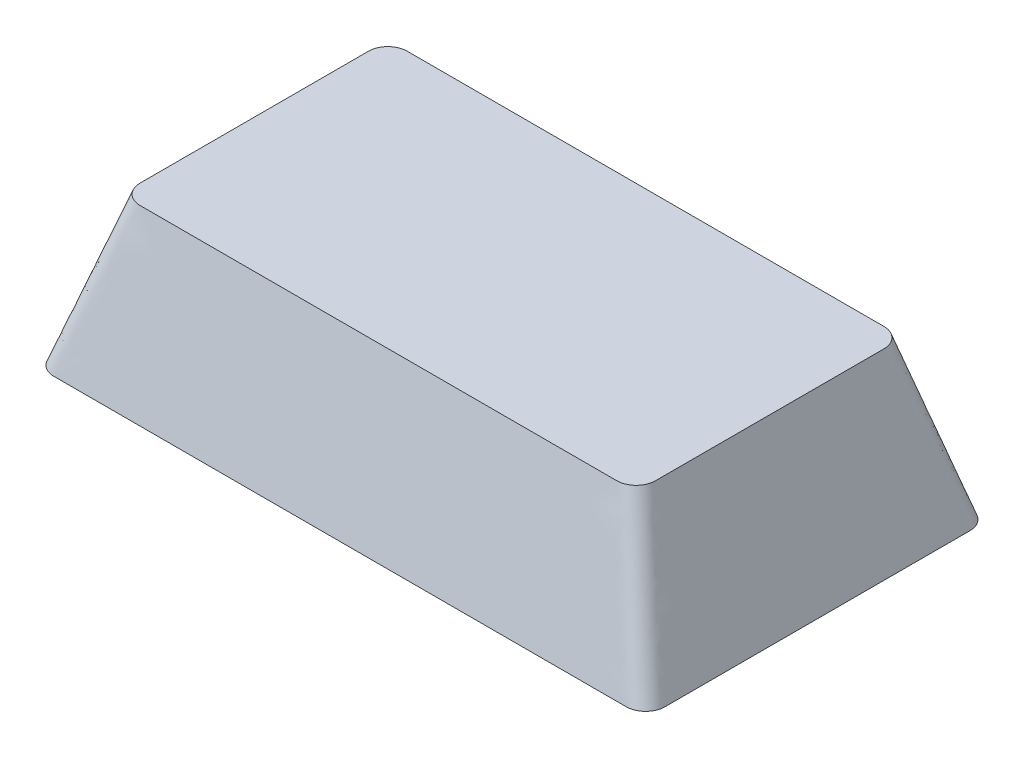
ISO-10303-21;
HEADER;
FILE_DESCRIPTION(('STEP AP214'),'2;1');
FILE_NAME('part.step','',(''),(''),'','','');
FILE_SCHEMA(('AUTOMOTIVE_DESIGN { 1 0 10303 214 1 1 1 1 }'));
ENDSEC;
DATA;
#1=APPLICATION_CONTEXT('core data for automotive mechanical design processes');
#2=APPLICATION_PROTOCOL_DEFINITION('international standard','automotive_design',2000,#1);
#3=PRODUCT_CONTEXT('',#1,'mechanical');
#4=PRODUCT('Part','Part','',(#3));
#5=PRODUCT_RELATED_PRODUCT_CATEGORY('part','',(#4));
#6=PRODUCT_DEFINITION_FORMATION('','',#4);
#7=PRODUCT_DEFINITION_CONTEXT('part definition',#1,'design');
#8=PRODUCT_DEFINITION('design','',#6,#7);
#9=PRODUCT_DEFINITION_SHAPE('','',#8);
#10=(LENGTH_UNIT() NAMED_UNIT(*) SI_UNIT(.MILLI.,.METRE.));
#11=(NAMED_UNIT(*) PLANE_ANGLE_UNIT() SI_UNIT($,.RADIAN.));
#12=(NAMED_UNIT(*) SI_UNIT($,.STERADIAN.) SOLID_ANGLE_UNIT());
#13=UNCERTAINTY_MEASURE_WITH_UNIT(LENGTH_MEASURE(1.E-05),#10,'distance_accuracy_value','');
#14=(GEOMETRIC_REPRESENTATION_CONTEXT(3) GLOBAL_UNCERTAINTY_ASSIGNED_CONTEXT((#13)) GLOBAL_UNIT_ASSIGNED_CONTEXT((#10,
#11,#12)) REPRESENTATION_CONTEXT('',''));
#15=CARTESIAN_POINT('',(0.,0.,0.));
#16=DIRECTION('',(0.,0.,1.));
#17=DIRECTION('',(1.,0.,0.));
#18=AXIS2_PLACEMENT_3D('',#15,#16,#17);
#19=CARTESIAN_POINT('',(-14.986,0.,-7.9883));
#20=DIRECTION('',(0.,-1.,0.));
#21=DIRECTION('',(0.,0.,-1.));
#22=AXIS2_PLACEMENT_3D('',#19,#20,#21);
#23=PLANE('',#22);
#24=CARTESIAN_POINT('',(-14.986,0.,-7.9883));
#25=DIRECTION('',(0.,1.,0.));
#26=DIRECTION('',(0.,0.,-1.));
#27=AXIS2_PLACEMENT_3D('',#24,#25,#26);
#28=CIRCLE('',#27,1.016);
#29=CARTESIAN_POINT('',(-14.9859999999087,0.,-9.0043));
#30=VERTEX_POINT('',#29);
#31=CARTESIAN_POINT('',(-16.002,0.,-7.9883));
#32=VERTEX_POINT('',#31);
#33=EDGE_CURVE('E323',#30,#32,#28,.T.);
#34=ORIENTED_EDGE('',*,*,#33,.F.);
#35=DIRECTION('',(-1.,0.,0.));
#36=VECTOR('',#35,1.);
#37=CARTESIAN_POINT('',(-14.986,0.,-9.0043));
#38=LINE('',#37,#36);
#39=CARTESIAN_POINT('',(14.986,0.,-9.0043));
#40=VERTEX_POINT('',#39);
#41=EDGE_CURVE('E578',#40,#30,#38,.T.);
#42=ORIENTED_EDGE('',*,*,#41,.F.);
#43=CARTESIAN_POINT('',(14.986,0.,-7.9883));
#44=DIRECTION('',(0.,1.,0.));
#45=DIRECTION('',(0.,0.,-1.));
#46=AXIS2_PLACEMENT_3D('',#43,#44,#45);
#47=CIRCLE('',#46,1.016);
#48=CARTESIAN_POINT('',(16.002,0.,-7.98829999999407));
#49=VERTEX_POINT('',#48);
#50=EDGE_CURVE('E562',#49,#40,#47,.T.);
#51=ORIENTED_EDGE('',*,*,#50,.F.);
#52=DIRECTION('',(0.,0.,-1.));
#53=VECTOR('',#52,1.);
#54=CARTESIAN_POINT('',(16.002,0.,7.9883));
#55=LINE('',#54,#53);
#56=CARTESIAN_POINT('',(16.002,0.,7.98829999998683));
#57=VERTEX_POINT('',#56);
#58=EDGE_CURVE('E551',#57,#49,#55,.T.);
#59=ORIENTED_EDGE('',*,*,#58,.F.);
#60=CARTESIAN_POINT('',(14.986,0.,7.9883));
#61=DIRECTION('',(0.,1.,0.));
#62=DIRECTION('',(0.,0.,1.));
#63=AXIS2_PLACEMENT_3D('',#60,#61,#62);
#64=CIRCLE('',#63,1.016);
#65=CARTESIAN_POINT('',(14.9859999999089,0.,9.0043));
#66=VERTEX_POINT('',#65);
#67=EDGE_CURVE('E549',#66,#57,#64,.T.);
#68=ORIENTED_EDGE('',*,*,#67,.F.);
#69=DIRECTION('',(1.,0.,0.));
#70=VECTOR('',#69,1.);
#71=CARTESIAN_POINT('',(-14.986,0.,9.0043));
#72=LINE('',#71,#70);
#73=CARTESIAN_POINT('',(-14.986,0.,9.0043));
#74=VERTEX_POINT('',#73);
#75=EDGE_CURVE('E532',#74,#66,#72,.T.);
#76=ORIENTED_EDGE('',*,*,#75,.F.);
#77=CARTESIAN_POINT('',(-14.986,0.,7.9883));
#78=DIRECTION('',(0.,1.,0.));
#79=DIRECTION('',(0.,0.,-1.));
#80=AXIS2_PLACEMENT_3D('',#77,#78,#79);
#81=CIRCLE('',#80,1.016);
#82=CARTESIAN_POINT('',(-16.002,0.,7.9883));
#83=VERTEX_POINT('',#82);
#84=EDGE_CURVE('E255',#83,#74,#81,.T.);
#85=ORIENTED_EDGE('',*,*,#84,.F.);
#86=DIRECTION('',(0.,0.,1.));
#87=VECTOR('',#86,1.);
#88=CARTESIAN_POINT('',(-16.002,0.,7.9883));
#89=LINE('',#88,#87);
#90=EDGE_CURVE('E13',#32,#83,#89,.T.);
#91=ORIENTED_EDGE('',*,*,#90,.F.);
#92=EDGE_LOOP('',(#34,#42,#51,#59,#68,#76,#85,#91));
#93=FACE_BOUND('',#92,.T.);
#94=ADVANCED_FACE('F244',(#93),#23,.T.);
#95=CARTESIAN_POINT('',(12.4841,8.001,-5.9817));
#96=DIRECTION('',(0.,-1.,0.));
#97=DIRECTION('',(0.,0.,-1.));
#98=AXIS2_PLACEMENT_3D('',#95,#96,#97);
#99=PLANE('',#98);
#100=CARTESIAN_POINT('',(12.4841,8.001,-5.9817));
#101=DIRECTION('',(0.,1.,0.));
#102=DIRECTION('',(0.,0.,-1.));
#103=AXIS2_PLACEMENT_3D('',#100,#101,#102);
#104=CIRCLE('',#103,1.016);
#105=CARTESIAN_POINT('',(13.5001,8.001,-5.9817));
#106=VERTEX_POINT('',#105);
#107=CARTESIAN_POINT('',(12.4841,8.001,-6.9977));
#108=VERTEX_POINT('',#107);
#109=EDGE_CURVE('E318',#106,#108,#104,.T.);
#110=ORIENTED_EDGE('',*,*,#109,.T.);
#111=DIRECTION('',(-1.,0.,0.));
#112=VECTOR('',#111,1.);
#113=CARTESIAN_POINT('',(-12.4841,8.001,-6.9977));
#114=LINE('',#113,#112);
#115=CARTESIAN_POINT('',(-12.4841,8.001,-6.9977));
#116=VERTEX_POINT('',#115);
#117=EDGE_CURVE('E310',#108,#116,#114,.T.);
#118=ORIENTED_EDGE('',*,*,#117,.T.);
#119=CARTESIAN_POINT('',(-12.4841,8.001,-5.9817));
#120=DIRECTION('',(0.,1.,0.));
#121=DIRECTION('',(0.,0.,-1.));
#122=AXIS2_PLACEMENT_3D('',#119,#120,#121);
#123=CIRCLE('',#122,1.016);
#124=CARTESIAN_POINT('',(-13.5001,8.001,-5.9817));
#125=VERTEX_POINT('',#124);
#126=EDGE_CURVE('E314',#116,#125,#123,.T.);
#127=ORIENTED_EDGE('',*,*,#126,.T.);
#128=DIRECTION('',(0.,0.,1.));
#129=VECTOR('',#128,1.);
#130=CARTESIAN_POINT('',(-13.5001,8.001,5.9817));
#131=LINE('',#130,#129);
#132=CARTESIAN_POINT('',(-13.5001,8.001,5.9817));
#133=VERTEX_POINT('',#132);
#134=EDGE_CURVE('E330',#125,#133,#131,.T.);
#135=ORIENTED_EDGE('',*,*,#134,.T.);
#136=CARTESIAN_POINT('',(-12.4841,8.001,5.9817));
#137=DIRECTION('',(0.,1.,0.));
#138=DIRECTION('',(0.,0.,-1.));
#139=AXIS2_PLACEMENT_3D('',#136,#137,#138);
#140=CIRCLE('',#139,1.016);
#141=CARTESIAN_POINT('',(-12.4841,8.001,6.9977));
#142=VERTEX_POINT('',#141);
#143=EDGE_CURVE('E470',#133,#142,#140,.T.);
#144=ORIENTED_EDGE('',*,*,#143,.T.);
#145=DIRECTION('',(1.,0.,0.));
#146=VECTOR('',#145,1.);
#147=CARTESIAN_POINT('',(-12.4841,8.001,6.9977));
#148=LINE('',#147,#146);
#149=CARTESIAN_POINT('',(12.4841,8.001,6.9977));
#150=VERTEX_POINT('',#149);
#151=EDGE_CURVE('E483',#142,#150,#148,.T.);
#152=ORIENTED_EDGE('',*,*,#151,.T.);
#153=CARTESIAN_POINT('',(12.4841,8.001,5.9817));
#154=DIRECTION('',(0.,1.,0.));
#155=DIRECTION('',(0.,0.,1.));
#156=AXIS2_PLACEMENT_3D('',#153,#154,#155);
#157=CIRCLE('',#156,1.016);
#158=CARTESIAN_POINT('',(13.5001,8.001,5.9817));
#159=VERTEX_POINT('',#158);
#160=EDGE_CURVE('E486',#150,#159,#157,.T.);
#161=ORIENTED_EDGE('',*,*,#160,.T.);
#162=DIRECTION('',(0.,0.,-1.));
#163=VECTOR('',#162,1.);
#164=CARTESIAN_POINT('',(13.5001,8.001,5.9817));
#165=LINE('',#164,#163);
#166=EDGE_CURVE('E505',#159,#106,#165,.T.);
#167=ORIENTED_EDGE('',*,*,#166,.T.);
#168=EDGE_LOOP('',(#110,#118,#127,#135,#144,#152,#161,#167));
#169=FACE_BOUND('',#168,.T.);
#170=ADVANCED_FACE('F313',(#169),#99,.F.);
#171=CARTESIAN_POINT('',(-12.4840999992464,8.001,-6.9977));
#172=CARTESIAN_POINT('',(-14.9859999991044,0.,-9.0043));
#173=CARTESIAN_POINT('',(-10.3930351284182,8.001,-6.9977));
#174=CARTESIAN_POINT('',(-12.5010479289686,0.,-9.0043));
#175=CARTESIAN_POINT('',(-6.22659208079639,8.00099999999999,-6.99770000000001));
#176=CARTESIAN_POINT('',(-7.51221633537314,0.,-9.0043));
#177=CARTESIAN_POINT('',(0.,8.00100000000001,-6.99769999999999));
#178=CARTESIAN_POINT('',(0.,0.,-9.0043));
#179=CARTESIAN_POINT('',(6.22659208079639,8.00099999999999,-6.99770000000001));
#180=CARTESIAN_POINT('',(7.51221633537315,0.,-9.00429999999999));
#181=CARTESIAN_POINT('',(10.3930351284182,8.001,-6.9977));
#182=CARTESIAN_POINT('',(12.5010479289686,0.,-9.0043));
#183=CARTESIAN_POINT('',(12.6067125499557,8.001,-6.9977));
#184=CARTESIAN_POINT('',(15.1317086836891,0.,-9.0043));
#185=CARTESIAN_POINT('',(12.8693281170297,8.00099999999999,-6.95260227707256));
#186=CARTESIAN_POINT('',(15.3972946631212,0.,-8.94366695953322));
#187=CARTESIAN_POINT('',(13.232695635871,8.00100000000001,-6.71352996460478));
#188=CARTESIAN_POINT('',(15.7154501451653,0.,-8.72892720433833));
#189=CARTESIAN_POINT('',(13.4591022496599,8.00099999999999,-6.35124617597646));
#190=CARTESIAN_POINT('',(15.9366225736122,0.,-8.41191938841098));
#191=CARTESIAN_POINT('',(13.5001,8.001,-6.09907833395586));
#192=CARTESIAN_POINT('',(16.002,0.,-8.14041919225854));
#193=CARTESIAN_POINT('',(13.5001,8.001,-4.96913424571762));
#194=CARTESIAN_POINT('',(16.002,0.,-6.67604177091302));
#195=CARTESIAN_POINT('',(13.5001,8.001,-2.96796061473786));
#196=CARTESIAN_POINT('',(16.002,0.,-4.02345676288969));
#197=CARTESIAN_POINT('',(13.5001,8.001,0.));
#198=CARTESIAN_POINT('',(16.002,0.,0.));
#199=CARTESIAN_POINT('',(13.5001,8.001,2.96796061473786));
#200=CARTESIAN_POINT('',(16.002,0.,4.0234567628897));
#201=CARTESIAN_POINT('',(13.5001,8.001,4.96913424571762));
#202=CARTESIAN_POINT('',(16.002,0.,6.67604177091302));
#203=CARTESIAN_POINT('',(13.5001,8.001,6.09907833395586));
#204=CARTESIAN_POINT('',(16.002,0.,8.14041919225854));
#205=CARTESIAN_POINT('',(13.4591022496599,8.001,6.35124617597647));
#206=CARTESIAN_POINT('',(15.9366225736122,0.,8.41191938841096));
#207=CARTESIAN_POINT('',(13.232695635871,8.00099999999999,6.71352996460477));
#208=CARTESIAN_POINT('',(15.7154501451653,0.,8.72892720433833));
#209=CARTESIAN_POINT('',(12.8693281170297,8.001,6.95260227707256));
#210=CARTESIAN_POINT('',(15.3972946631212,0.,8.94366695953322));
#211=CARTESIAN_POINT('',(12.6067125499557,8.001,6.9977));
#212=CARTESIAN_POINT('',(15.1317086836892,0.,9.0043));
#213=CARTESIAN_POINT('',(10.3930351284182,8.001,6.9977));
#214=CARTESIAN_POINT('',(12.5010479289686,0.,9.0043));
#215=CARTESIAN_POINT('',(6.22659208079639,8.00100000000001,6.99770000000001));
#216=CARTESIAN_POINT('',(7.51221633537315,0.,9.0043));
#217=CARTESIAN_POINT('',(0.,8.00099999999999,6.99769999999999));
#218=CARTESIAN_POINT('',(0.,0.,9.0043));
#219=CARTESIAN_POINT('',(-6.22659208079638,8.001,6.99770000000001));
#220=CARTESIAN_POINT('',(-7.51221633537314,0.,9.00429999999999));
#221=CARTESIAN_POINT('',(-10.3930351284182,8.001,6.9977));
#222=CARTESIAN_POINT('',(-12.5010479289686,0.,9.0043));
#223=CARTESIAN_POINT('',(-12.6067125499557,8.001,6.9977));
#224=CARTESIAN_POINT('',(-15.1317086836892,0.,9.0043));
#225=CARTESIAN_POINT('',(-12.8693281170297,8.00099999999999,6.95260227707256));
#226=CARTESIAN_POINT('',(-15.3972946631212,0.,8.94366695953322));
#227=CARTESIAN_POINT('',(-13.232695635871,8.00100000000001,6.71352996460477));
#228=CARTESIAN_POINT('',(-15.7154501451653,0.,8.72892720433833));
#229=CARTESIAN_POINT('',(-13.4591022496599,8.00099999999999,6.35124617597647));
#230=CARTESIAN_POINT('',(-15.9366225736122,0.,8.41191938841097));
#231=CARTESIAN_POINT('',(-13.5001,8.001,6.09907833395586));
#232=CARTESIAN_POINT('',(-16.002,0.,8.14041919225854));
#233=CARTESIAN_POINT('',(-13.5001,8.001,4.96913424571762));
#234=CARTESIAN_POINT('',(-16.002,0.,6.67604177091301));
#235=CARTESIAN_POINT('',(-13.5001,8.001,2.96796061473786));
#236=CARTESIAN_POINT('',(-16.002,0.,4.02345676288968));
#237=CARTESIAN_POINT('',(-13.5001,8.001,0.));
#238=CARTESIAN_POINT('',(-16.002,0.,0.));
#239=CARTESIAN_POINT('',(-13.5001,8.001,-2.96796061473786));
#240=CARTESIAN_POINT('',(-16.002,0.,-4.02345676288969));
#241=CARTESIAN_POINT('',(-13.5001,8.001,-4.96913424571762));
#242=CARTESIAN_POINT('',(-16.002,0.,-6.67604177091301));
#243=CARTESIAN_POINT('',(-13.5001,8.001,-6.09907833395586));
#244=CARTESIAN_POINT('',(-16.002,0.,-8.14041919225854));
#245=CARTESIAN_POINT('',(-13.4591022496599,8.00099999999999,-6.35124617597647));
#246=CARTESIAN_POINT('',(-15.9366225736122,0.,-8.41191938841096));
#247=CARTESIAN_POINT('',(-13.232695635871,8.001,-6.71352996460476));
#248=CARTESIAN_POINT('',(-15.7154501451653,0.,-8.72892720433833));
#249=CARTESIAN_POINT('',(-12.8693281170297,8.001,-6.95260227707256));
#250=CARTESIAN_POINT('',(-15.3972946631212,0.,-8.94366695953321));
#251=CARTESIAN_POINT('',(-12.6067125499557,8.001,-6.9977));
#252=CARTESIAN_POINT('',(-15.1317086836892,0.,-9.0043));
#253=CARTESIAN_POINT('',(-12.4840999992464,8.001,-6.9977));
#254=CARTESIAN_POINT('',(-14.9859999991044,0.,-9.0043));
#255=B_SPLINE_SURFACE_WITH_KNOTS('',3,1,((#171,#172),(#173,#174),(#175,#176),(#177,#178),(#179,
#180),(#181,#182),(#183,#184),(#185,#186),(#187,#188),(#189,#190),(#191,#192),(#193,#194),(#195,
#196),(#197,#198),(#199,#200),(#201,#202),(#203,#204),(#205,#206),(#207,#208),(#209,#210),(#211,
#212),(#213,#214),(#215,#216),(#217,#218),(#219,#220),(#221,#222),(#223,#224),(#225,#226),(#227,
#228),(#229,#230),(#231,#232),(#233,#234),(#235,#236),(#237,#238),(#239,#240),(#241,#242),(#243,
#244),(#245,#246),(#247,#248),(#249,#250),(#251,#252),(#253,#254)),.UNSPECIFIED.,.T.,.F.,.F.,(4,
1,1,1,2,1,1,1,2,1,1,1,2,1,1,1,2,1,1,1,2,1,1,1,2,1,1,1,2,1,1,1,4),(2,2),(0.,0.0770130919942433,
0.154026183988487,0.23103927598273,0.308052367976973,0.312568139715649,0.317083911454324,
0.321599683192999,0.326115454931675,0.365070819460081,0.404026183988487,0.442981548516893,
0.481936913045298,0.486452684783974,0.490968456522649,0.495484228261325,0.5,0.577013091994243,
0.654026183988487,0.73103927598273,0.808052367976973,0.812568139715649,0.817083911454324,
0.821599683192999,0.826115454931675,0.865070819460081,0.904026183988487,0.942981548516893,
0.981936913045298,0.986452684783974,0.990968456522649,0.995484228261325,1.),(0.,1.),.UNSPECIFIED.);
#256=ORIENTED_EDGE('',*,*,#109,.F.);
#257=ORIENTED_EDGE('',*,*,#166,.F.);
#258=ORIENTED_EDGE('',*,*,#160,.F.);
#259=ORIENTED_EDGE('',*,*,#151,.F.);
#260=ORIENTED_EDGE('',*,*,#143,.F.);
#261=ORIENTED_EDGE('',*,*,#134,.F.);
#262=ORIENTED_EDGE('',*,*,#126,.F.);
#263=ORIENTED_EDGE('',*,*,#117,.F.);
#264=EDGE_LOOP('',(#256,#257,#258,#259,#260,#261,#262,#263));
#265=FACE_BOUND('',#264,.T.);
#266=ORIENTED_EDGE('',*,*,#90,.T.);
#267=ORIENTED_EDGE('',*,*,#84,.T.);
#268=ORIENTED_EDGE('',*,*,#75,.T.);
#269=ORIENTED_EDGE('',*,*,#67,.T.);
#270=ORIENTED_EDGE('',*,*,#58,.T.);
#271=ORIENTED_EDGE('',*,*,#50,.T.);
#272=ORIENTED_EDGE('',*,*,#41,.T.);
#273=ORIENTED_EDGE('',*,*,#33,.T.);
#274=EDGE_LOOP('',(#266,#267,#268,#269,#270,#271,#272,#273));
#275=FACE_BOUND('',#274,.T.);
#276=ADVANCED_FACE('F328',(#265,#275),#255,.T.);
#277=CLOSED_SHELL('',(#94,#170,#276));
#278=MANIFOLD_SOLID_BREP('B2',#277);
#279=ADVANCED_BREP_SHAPE_REPRESENTATION('',(#18,#278),#14);
#280=SHAPE_DEFINITION_REPRESENTATION(#9,#279);
ENDSEC;
END-ISO-10303-21;
